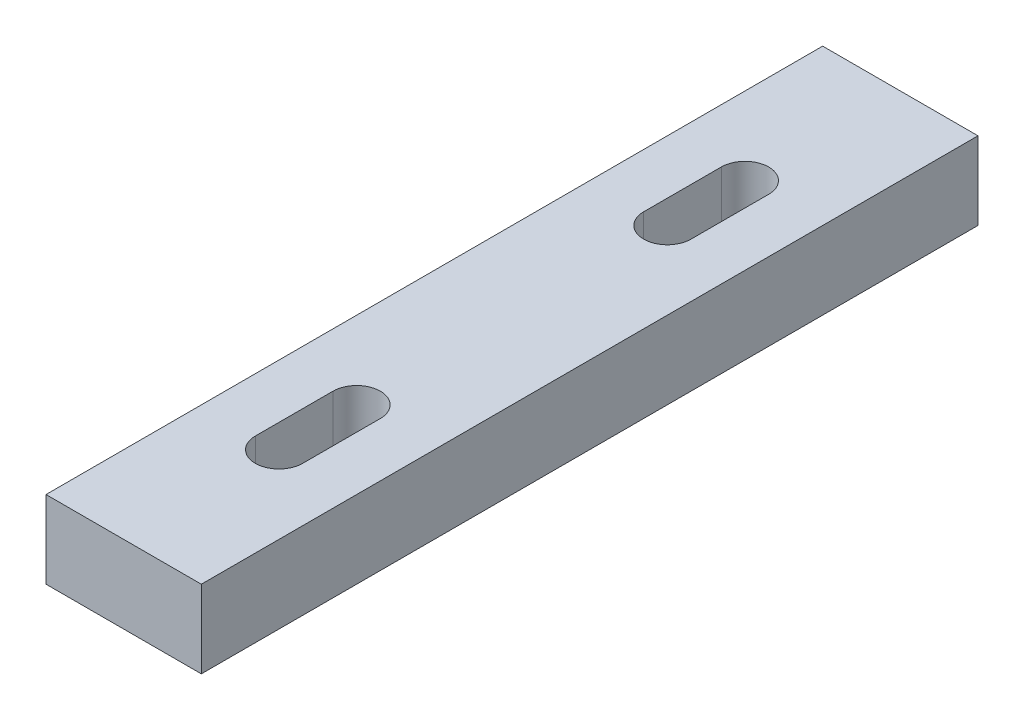
ISO-10303-21;
HEADER;
FILE_DESCRIPTION(('STEP AP214'),'2;1');
FILE_NAME('part.step','',(''),(''),'','','');
FILE_SCHEMA(('AUTOMOTIVE_DESIGN { 1 0 10303 214 1 1 1 1 }'));
ENDSEC;
DATA;
#1=APPLICATION_CONTEXT('core data for automotive mechanical design processes');
#2=APPLICATION_PROTOCOL_DEFINITION('international standard','automotive_design',2000,#1);
#3=PRODUCT_CONTEXT('',#1,'mechanical');
#4=PRODUCT('Part','Part','',(#3));
#5=PRODUCT_RELATED_PRODUCT_CATEGORY('part','',(#4));
#6=PRODUCT_DEFINITION_FORMATION('','',#4);
#7=PRODUCT_DEFINITION_CONTEXT('part definition',#1,'design');
#8=PRODUCT_DEFINITION('design','',#6,#7);
#9=PRODUCT_DEFINITION_SHAPE('','',#8);
#10=(LENGTH_UNIT() NAMED_UNIT(*) SI_UNIT(.MILLI.,.METRE.));
#11=(NAMED_UNIT(*) PLANE_ANGLE_UNIT() SI_UNIT($,.RADIAN.));
#12=(NAMED_UNIT(*) SI_UNIT($,.STERADIAN.) SOLID_ANGLE_UNIT());
#13=UNCERTAINTY_MEASURE_WITH_UNIT(LENGTH_MEASURE(1.E-05),#10,'distance_accuracy_value','');
#14=(GEOMETRIC_REPRESENTATION_CONTEXT(3) GLOBAL_UNCERTAINTY_ASSIGNED_CONTEXT((#13)) GLOBAL_UNIT_ASSIGNED_CONTEXT((#10,
#11,#12)) REPRESENTATION_CONTEXT('',''));
#15=CARTESIAN_POINT('',(0.,0.,0.));
#16=DIRECTION('',(0.,0.,1.));
#17=DIRECTION('',(1.,0.,0.));
#18=AXIS2_PLACEMENT_3D('',#15,#16,#17);
#19=CARTESIAN_POINT('',(9.99999999999999,10.,-50.));
#20=DIRECTION('',(-1.,0.,0.));
#21=DIRECTION('',(0.,0.,1.));
#22=AXIS2_PLACEMENT_3D('',#19,#20,#21);
#23=PLANE('',#22);
#24=DIRECTION('',(0.,0.,-1.));
#25=VECTOR('',#24,1.);
#26=CARTESIAN_POINT('',(9.99999999999999,0.,-50.));
#27=LINE('',#26,#25);
#28=CARTESIAN_POINT('',(10.,0.,50.));
#29=VERTEX_POINT('',#28);
#30=CARTESIAN_POINT('',(9.99999999999999,0.,-50.));
#31=VERTEX_POINT('',#30);
#32=EDGE_CURVE('E186',#29,#31,#27,.T.);
#33=ORIENTED_EDGE('',*,*,#32,.T.);
#34=DIRECTION('',(0.,-1.,0.));
#35=VECTOR('',#34,1.);
#36=CARTESIAN_POINT('',(9.99999999999999,10.,-50.));
#37=LINE('',#36,#35);
#38=CARTESIAN_POINT('',(9.99999999999999,10.,-50.));
#39=VERTEX_POINT('',#38);
#40=EDGE_CURVE('E11',#39,#31,#37,.T.);
#41=ORIENTED_EDGE('',*,*,#40,.F.);
#42=DIRECTION('',(0.,0.,-1.));
#43=VECTOR('',#42,1.);
#44=CARTESIAN_POINT('',(9.99999999999999,10.,-50.));
#45=LINE('',#44,#43);
#46=CARTESIAN_POINT('',(10.,10.,50.));
#47=VERTEX_POINT('',#46);
#48=EDGE_CURVE('E187',#47,#39,#45,.T.);
#49=ORIENTED_EDGE('',*,*,#48,.F.);
#50=DIRECTION('',(0.,-1.,0.));
#51=VECTOR('',#50,1.);
#52=CARTESIAN_POINT('',(10.,10.,50.));
#53=LINE('',#52,#51);
#54=EDGE_CURVE('E197',#47,#29,#53,.T.);
#55=ORIENTED_EDGE('',*,*,#54,.T.);
#56=EDGE_LOOP('',(#33,#41,#49,#55));
#57=FACE_BOUND('',#56,.T.);
#58=ADVANCED_FACE('F37',(#57),#23,.F.);
#59=CARTESIAN_POINT('',(-10.,10.,-50.));
#60=DIRECTION('',(0.,0.,1.));
#61=DIRECTION('',(1.,0.,0.));
#62=AXIS2_PLACEMENT_3D('',#59,#60,#61);
#63=PLANE('',#62);
#64=DIRECTION('',(-1.,0.,0.));
#65=VECTOR('',#64,1.);
#66=CARTESIAN_POINT('',(-10.,0.,-50.));
#67=LINE('',#66,#65);
#68=CARTESIAN_POINT('',(-10.,0.,-50.));
#69=VERTEX_POINT('',#68);
#70=EDGE_CURVE('E200',#31,#69,#67,.T.);
#71=ORIENTED_EDGE('',*,*,#70,.T.);
#72=DIRECTION('',(0.,-1.,0.));
#73=VECTOR('',#72,1.);
#74=CARTESIAN_POINT('',(-10.,10.,-50.));
#75=LINE('',#74,#73);
#76=CARTESIAN_POINT('',(-10.,10.,-50.));
#77=VERTEX_POINT('',#76);
#78=EDGE_CURVE('E44',#77,#69,#75,.T.);
#79=ORIENTED_EDGE('',*,*,#78,.F.);
#80=DIRECTION('',(-1.,0.,0.));
#81=VECTOR('',#80,1.);
#82=CARTESIAN_POINT('',(-10.,10.,-50.));
#83=LINE('',#82,#81);
#84=EDGE_CURVE('E190',#39,#77,#83,.T.);
#85=ORIENTED_EDGE('',*,*,#84,.F.);
#86=ORIENTED_EDGE('',*,*,#40,.T.);
#87=EDGE_LOOP('',(#71,#79,#85,#86));
#88=FACE_BOUND('',#87,.T.);
#89=ADVANCED_FACE('F229',(#88),#63,.F.);
#90=CARTESIAN_POINT('',(-10.,10.,-50.));
#91=DIRECTION('',(1.,0.,0.));
#92=DIRECTION('',(0.,0.,-1.));
#93=AXIS2_PLACEMENT_3D('',#90,#91,#92);
#94=PLANE('',#93);
#95=DIRECTION('',(0.,0.,1.));
#96=VECTOR('',#95,1.);
#97=CARTESIAN_POINT('',(-10.,0.,-50.));
#98=LINE('',#97,#96);
#99=CARTESIAN_POINT('',(-9.99999999999999,0.,50.));
#100=VERTEX_POINT('',#99);
#101=EDGE_CURVE('E202',#69,#100,#98,.T.);
#102=ORIENTED_EDGE('',*,*,#101,.T.);
#103=DIRECTION('',(0.,-1.,0.));
#104=VECTOR('',#103,1.);
#105=CARTESIAN_POINT('',(-9.99999999999999,10.,50.));
#106=LINE('',#105,#104);
#107=CARTESIAN_POINT('',(-9.99999999999999,10.,50.));
#108=VERTEX_POINT('',#107);
#109=EDGE_CURVE('E207',#108,#100,#106,.T.);
#110=ORIENTED_EDGE('',*,*,#109,.F.);
#111=DIRECTION('',(0.,0.,1.));
#112=VECTOR('',#111,1.);
#113=CARTESIAN_POINT('',(-10.,10.,-50.));
#114=LINE('',#113,#112);
#115=EDGE_CURVE('E193',#77,#108,#114,.T.);
#116=ORIENTED_EDGE('',*,*,#115,.F.);
#117=ORIENTED_EDGE('',*,*,#78,.T.);
#118=EDGE_LOOP('',(#102,#110,#116,#117));
#119=FACE_BOUND('',#118,.T.);
#120=ADVANCED_FACE('F214',(#119),#94,.F.);
#121=CARTESIAN_POINT('',(-9.99999999999999,10.,50.));
#122=DIRECTION('',(0.,0.,-1.));
#123=DIRECTION('',(-1.,0.,0.));
#124=AXIS2_PLACEMENT_3D('',#121,#122,#123);
#125=PLANE('',#124);
#126=DIRECTION('',(1.,0.,0.));
#127=VECTOR('',#126,1.);
#128=CARTESIAN_POINT('',(-9.99999999999999,0.,50.));
#129=LINE('',#128,#127);
#130=EDGE_CURVE('E191',#100,#29,#129,.T.);
#131=ORIENTED_EDGE('',*,*,#130,.T.);
#132=ORIENTED_EDGE('',*,*,#54,.F.);
#133=DIRECTION('',(1.,0.,0.));
#134=VECTOR('',#133,1.);
#135=CARTESIAN_POINT('',(-9.99999999999999,10.,50.));
#136=LINE('',#135,#134);
#137=EDGE_CURVE('E195',#108,#47,#136,.T.);
#138=ORIENTED_EDGE('',*,*,#137,.F.);
#139=ORIENTED_EDGE('',*,*,#109,.T.);
#140=EDGE_LOOP('',(#131,#132,#138,#139));
#141=FACE_BOUND('',#140,.T.);
#142=ADVANCED_FACE('F223',(#141),#125,.F.);
#143=CARTESIAN_POINT('',(0.,10.,0.));
#144=DIRECTION('',(0.,1.,0.));
#145=DIRECTION('',(0.,0.,1.));
#146=AXIS2_PLACEMENT_3D('',#143,#144,#145);
#147=PLANE('',#146);
#148=CARTESIAN_POINT('',(0.,10.,20.));
#149=DIRECTION('',(0.,-1.,0.));
#150=DIRECTION('',(0.,0.,-1.));
#151=AXIS2_PLACEMENT_3D('',#148,#149,#150);
#152=CIRCLE('',#151,3.05);
#153=CARTESIAN_POINT('',(-3.05,10.,20.));
#154=VERTEX_POINT('',#153);
#155=CARTESIAN_POINT('',(3.05,10.,20.));
#156=VERTEX_POINT('',#155);
#157=EDGE_CURVE('E144',#154,#156,#152,.T.);
#158=ORIENTED_EDGE('',*,*,#157,.T.);
#159=DIRECTION('',(0.,0.,1.));
#160=VECTOR('',#159,1.);
#161=CARTESIAN_POINT('',(3.05,10.,30.));
#162=LINE('',#161,#160);
#163=CARTESIAN_POINT('',(3.05,10.,30.));
#164=VERTEX_POINT('',#163);
#165=EDGE_CURVE('E128',#156,#164,#162,.T.);
#166=ORIENTED_EDGE('',*,*,#165,.T.);
#167=CARTESIAN_POINT('',(0.,10.,30.));
#168=DIRECTION('',(0.,-1.,0.));
#169=DIRECTION('',(0.,0.,-1.));
#170=AXIS2_PLACEMENT_3D('',#167,#168,#169);
#171=CIRCLE('',#170,3.05);
#172=CARTESIAN_POINT('',(-3.05,10.,30.));
#173=VERTEX_POINT('',#172);
#174=EDGE_CURVE('E136',#164,#173,#171,.T.);
#175=ORIENTED_EDGE('',*,*,#174,.T.);
#176=DIRECTION('',(0.,0.,-1.));
#177=VECTOR('',#176,1.);
#178=CARTESIAN_POINT('',(-3.05,10.,30.));
#179=LINE('',#178,#177);
#180=EDGE_CURVE('E51',#173,#154,#179,.T.);
#181=ORIENTED_EDGE('',*,*,#180,.T.);
#182=EDGE_LOOP('',(#158,#166,#175,#181));
#183=FACE_BOUND('',#182,.T.);
#184=CARTESIAN_POINT('',(0.,10.,-30.));
#185=DIRECTION('',(0.,1.,0.));
#186=DIRECTION('',(0.,0.,1.));
#187=AXIS2_PLACEMENT_3D('',#184,#185,#186);
#188=CIRCLE('',#187,3.05);
#189=CARTESIAN_POINT('',(3.05,10.,-30.));
#190=VERTEX_POINT('',#189);
#191=CARTESIAN_POINT('',(-3.05,10.,-30.));
#192=VERTEX_POINT('',#191);
#193=EDGE_CURVE('E165',#190,#192,#188,.T.);
#194=ORIENTED_EDGE('',*,*,#193,.F.);
#195=DIRECTION('',(0.,0.,-1.));
#196=VECTOR('',#195,1.);
#197=CARTESIAN_POINT('',(3.05,10.,-30.));
#198=LINE('',#197,#196);
#199=CARTESIAN_POINT('',(3.05,10.,-20.));
#200=VERTEX_POINT('',#199);
#201=EDGE_CURVE('E174',#200,#190,#198,.T.);
#202=ORIENTED_EDGE('',*,*,#201,.F.);
#203=CARTESIAN_POINT('',(0.,10.,-20.));
#204=DIRECTION('',(0.,1.,0.));
#205=DIRECTION('',(0.,0.,1.));
#206=AXIS2_PLACEMENT_3D('',#203,#204,#205);
#207=CIRCLE('',#206,3.05);
#208=CARTESIAN_POINT('',(-3.05,10.,-20.));
#209=VERTEX_POINT('',#208);
#210=EDGE_CURVE('E171',#209,#200,#207,.T.);
#211=ORIENTED_EDGE('',*,*,#210,.F.);
#212=DIRECTION('',(0.,0.,1.));
#213=VECTOR('',#212,1.);
#214=CARTESIAN_POINT('',(-3.05,10.,-30.));
#215=LINE('',#214,#213);
#216=EDGE_CURVE('E167',#192,#209,#215,.T.);
#217=ORIENTED_EDGE('',*,*,#216,.F.);
#218=EDGE_LOOP('',(#194,#202,#211,#217));
#219=FACE_BOUND('',#218,.T.);
#220=ORIENTED_EDGE('',*,*,#48,.T.);
#221=ORIENTED_EDGE('',*,*,#84,.T.);
#222=ORIENTED_EDGE('',*,*,#115,.T.);
#223=ORIENTED_EDGE('',*,*,#137,.T.);
#224=EDGE_LOOP('',(#220,#221,#222,#223));
#225=FACE_BOUND('',#224,.T.);
#226=ADVANCED_FACE('F141',(#183,#219,#225),#147,.T.);
#227=CARTESIAN_POINT('',(0.,0.,0.));
#228=DIRECTION('',(0.,1.,0.));
#229=DIRECTION('',(0.,0.,1.));
#230=AXIS2_PLACEMENT_3D('',#227,#228,#229);
#231=PLANE('',#230);
#232=DIRECTION('',(0.,0.,-1.));
#233=VECTOR('',#232,1.);
#234=CARTESIAN_POINT('',(3.05,0.,30.));
#235=LINE('',#234,#233);
#236=CARTESIAN_POINT('',(3.05,0.,30.));
#237=VERTEX_POINT('',#236);
#238=CARTESIAN_POINT('',(3.05,0.,20.));
#239=VERTEX_POINT('',#238);
#240=EDGE_CURVE('E131',#237,#239,#235,.T.);
#241=ORIENTED_EDGE('',*,*,#240,.T.);
#242=CARTESIAN_POINT('',(0.,0.,20.));
#243=DIRECTION('',(0.,1.,0.));
#244=DIRECTION('',(0.,0.,1.));
#245=AXIS2_PLACEMENT_3D('',#242,#243,#244);
#246=CIRCLE('',#245,3.05);
#247=CARTESIAN_POINT('',(-3.05,0.,20.));
#248=VERTEX_POINT('',#247);
#249=EDGE_CURVE('E155',#239,#248,#246,.T.);
#250=ORIENTED_EDGE('',*,*,#249,.T.);
#251=DIRECTION('',(0.,0.,1.));
#252=VECTOR('',#251,1.);
#253=CARTESIAN_POINT('',(-3.05,0.,30.));
#254=LINE('',#253,#252);
#255=CARTESIAN_POINT('',(-3.05,0.,30.));
#256=VERTEX_POINT('',#255);
#257=EDGE_CURVE('E274',#248,#256,#254,.T.);
#258=ORIENTED_EDGE('',*,*,#257,.T.);
#259=CARTESIAN_POINT('',(0.,0.,30.));
#260=DIRECTION('',(0.,1.,0.));
#261=DIRECTION('',(0.,0.,1.));
#262=AXIS2_PLACEMENT_3D('',#259,#260,#261);
#263=CIRCLE('',#262,3.05);
#264=EDGE_CURVE('E168',#256,#237,#263,.T.);
#265=ORIENTED_EDGE('',*,*,#264,.T.);
#266=EDGE_LOOP('',(#241,#250,#258,#265));
#267=FACE_BOUND('',#266,.T.);
#268=DIRECTION('',(0.,0.,1.));
#269=VECTOR('',#268,1.);
#270=CARTESIAN_POINT('',(3.05,0.,-30.));
#271=LINE('',#270,#269);
#272=CARTESIAN_POINT('',(3.05,0.,-30.));
#273=VERTEX_POINT('',#272);
#274=CARTESIAN_POINT('',(3.05,0.,-20.));
#275=VERTEX_POINT('',#274);
#276=EDGE_CURVE('E159',#273,#275,#271,.T.);
#277=ORIENTED_EDGE('',*,*,#276,.F.);
#278=CARTESIAN_POINT('',(0.,0.,-30.));
#279=DIRECTION('',(0.,1.,0.));
#280=DIRECTION('',(0.,0.,1.));
#281=AXIS2_PLACEMENT_3D('',#278,#279,#280);
#282=CIRCLE('',#281,3.05);
#283=CARTESIAN_POINT('',(-3.05,0.,-30.));
#284=VERTEX_POINT('',#283);
#285=EDGE_CURVE('E162',#284,#273,#282,.F.);
#286=ORIENTED_EDGE('',*,*,#285,.F.);
#287=DIRECTION('',(0.,0.,-1.));
#288=VECTOR('',#287,1.);
#289=CARTESIAN_POINT('',(-3.05,0.,-30.));
#290=LINE('',#289,#288);
#291=CARTESIAN_POINT('',(-3.05,0.,-20.));
#292=VERTEX_POINT('',#291);
#293=EDGE_CURVE('E164',#292,#284,#290,.T.);
#294=ORIENTED_EDGE('',*,*,#293,.F.);
#295=CARTESIAN_POINT('',(0.,0.,-20.));
#296=DIRECTION('',(0.,1.,0.));
#297=DIRECTION('',(0.,0.,1.));
#298=AXIS2_PLACEMENT_3D('',#295,#296,#297);
#299=CIRCLE('',#298,3.05);
#300=EDGE_CURVE('E156',#275,#292,#299,.F.);
#301=ORIENTED_EDGE('',*,*,#300,.F.);
#302=EDGE_LOOP('',(#277,#286,#294,#301));
#303=FACE_BOUND('',#302,.T.);
#304=ORIENTED_EDGE('',*,*,#32,.F.);
#305=ORIENTED_EDGE('',*,*,#130,.F.);
#306=ORIENTED_EDGE('',*,*,#101,.F.);
#307=ORIENTED_EDGE('',*,*,#70,.F.);
#308=EDGE_LOOP('',(#304,#305,#306,#307));
#309=FACE_BOUND('',#308,.T.);
#310=ADVANCED_FACE('F220',(#267,#303,#309),#231,.F.);
#311=CARTESIAN_POINT('',(0.,-17.2168522093907,-30.));
#312=DIRECTION('',(0.,1.,0.));
#313=DIRECTION('',(0.,0.,1.));
#314=AXIS2_PLACEMENT_3D('',#311,#312,#313);
#315=CYLINDRICAL_SURFACE('',#314,3.05);
#316=ORIENTED_EDGE('',*,*,#285,.T.);
#317=DIRECTION('',(0.,1.,0.));
#318=VECTOR('',#317,1.);
#319=CARTESIAN_POINT('',(3.05,-17.2168522093907,-30.));
#320=LINE('',#319,#318);
#321=EDGE_CURVE('E160',#273,#190,#320,.T.);
#322=ORIENTED_EDGE('',*,*,#321,.T.);
#323=ORIENTED_EDGE('',*,*,#193,.T.);
#324=DIRECTION('',(0.,1.,0.));
#325=VECTOR('',#324,1.);
#326=CARTESIAN_POINT('',(-3.05,-17.2168522093907,-30.));
#327=LINE('',#326,#325);
#328=EDGE_CURVE('E177',#284,#192,#327,.T.);
#329=ORIENTED_EDGE('',*,*,#328,.F.);
#330=EDGE_LOOP('',(#316,#322,#323,#329));
#331=FACE_BOUND('',#330,.T.);
#332=ADVANCED_FACE('F241',(#331),#315,.F.);
#333=CARTESIAN_POINT('',(3.05,-17.2168522093907,-30.));
#334=DIRECTION('',(1.,0.,0.));
#335=DIRECTION('',(0.,0.,-1.));
#336=AXIS2_PLACEMENT_3D('',#333,#334,#335);
#337=PLANE('',#336);
#338=ORIENTED_EDGE('',*,*,#276,.T.);
#339=DIRECTION('',(0.,1.,0.));
#340=VECTOR('',#339,1.);
#341=CARTESIAN_POINT('',(3.05,-17.2168522093907,-20.));
#342=LINE('',#341,#340);
#343=EDGE_CURVE('E179',#275,#200,#342,.T.);
#344=ORIENTED_EDGE('',*,*,#343,.T.);
#345=ORIENTED_EDGE('',*,*,#201,.T.);
#346=ORIENTED_EDGE('',*,*,#321,.F.);
#347=EDGE_LOOP('',(#338,#344,#345,#346));
#348=FACE_BOUND('',#347,.T.);
#349=ADVANCED_FACE('F247',(#348),#337,.F.);
#350=CARTESIAN_POINT('',(0.,-17.2168522093907,-20.));
#351=DIRECTION('',(0.,1.,0.));
#352=DIRECTION('',(0.,0.,1.));
#353=AXIS2_PLACEMENT_3D('',#350,#351,#352);
#354=CYLINDRICAL_SURFACE('',#353,3.05);
#355=ORIENTED_EDGE('',*,*,#300,.T.);
#356=DIRECTION('',(0.,1.,0.));
#357=VECTOR('',#356,1.);
#358=CARTESIAN_POINT('',(-3.05,-17.2168522093907,-20.));
#359=LINE('',#358,#357);
#360=EDGE_CURVE('E181',#292,#209,#359,.T.);
#361=ORIENTED_EDGE('',*,*,#360,.T.);
#362=ORIENTED_EDGE('',*,*,#210,.T.);
#363=ORIENTED_EDGE('',*,*,#343,.F.);
#364=EDGE_LOOP('',(#355,#361,#362,#363));
#365=FACE_BOUND('',#364,.T.);
#366=ADVANCED_FACE('F252',(#365),#354,.F.);
#367=CARTESIAN_POINT('',(-3.05,-17.2168522093907,-30.));
#368=DIRECTION('',(-1.,0.,0.));
#369=DIRECTION('',(0.,0.,1.));
#370=AXIS2_PLACEMENT_3D('',#367,#368,#369);
#371=PLANE('',#370);
#372=ORIENTED_EDGE('',*,*,#293,.T.);
#373=ORIENTED_EDGE('',*,*,#328,.T.);
#374=ORIENTED_EDGE('',*,*,#216,.T.);
#375=ORIENTED_EDGE('',*,*,#360,.F.);
#376=EDGE_LOOP('',(#372,#373,#374,#375));
#377=FACE_BOUND('',#376,.T.);
#378=ADVANCED_FACE('F249',(#377),#371,.F.);
#379=CARTESIAN_POINT('',(3.05,-17.2168522093907,30.));
#380=DIRECTION('',(-1.,0.,0.));
#381=DIRECTION('',(0.,0.,1.));
#382=AXIS2_PLACEMENT_3D('',#379,#380,#381);
#383=PLANE('',#382);
#384=DIRECTION('',(0.,1.,0.));
#385=VECTOR('',#384,1.);
#386=CARTESIAN_POINT('',(3.05,-17.2168522093907,30.));
#387=LINE('',#386,#385);
#388=EDGE_CURVE('E59',#237,#164,#387,.T.);
#389=ORIENTED_EDGE('',*,*,#388,.T.);
#390=ORIENTED_EDGE('',*,*,#165,.F.);
#391=DIRECTION('',(0.,1.,0.));
#392=VECTOR('',#391,1.);
#393=CARTESIAN_POINT('',(3.05,-17.2168522093907,20.));
#394=LINE('',#393,#392);
#395=EDGE_CURVE('E133',#239,#156,#394,.T.);
#396=ORIENTED_EDGE('',*,*,#395,.F.);
#397=ORIENTED_EDGE('',*,*,#240,.F.);
#398=EDGE_LOOP('',(#389,#390,#396,#397));
#399=FACE_BOUND('',#398,.T.);
#400=ADVANCED_FACE('F125',(#399),#383,.T.);
#401=CARTESIAN_POINT('',(0.,-17.2168522093907,20.));
#402=DIRECTION('',(0.,1.,0.));
#403=DIRECTION('',(0.,0.,1.));
#404=AXIS2_PLACEMENT_3D('',#401,#402,#403);
#405=CYLINDRICAL_SURFACE('',#404,3.05);
#406=ORIENTED_EDGE('',*,*,#395,.T.);
#407=ORIENTED_EDGE('',*,*,#157,.F.);
#408=DIRECTION('',(0.,1.,0.));
#409=VECTOR('',#408,1.);
#410=CARTESIAN_POINT('',(-3.05,-17.2168522093907,20.));
#411=LINE('',#410,#409);
#412=EDGE_CURVE('E151',#248,#154,#411,.T.);
#413=ORIENTED_EDGE('',*,*,#412,.F.);
#414=ORIENTED_EDGE('',*,*,#249,.F.);
#415=EDGE_LOOP('',(#406,#407,#413,#414));
#416=FACE_BOUND('',#415,.T.);
#417=ADVANCED_FACE('F265',(#416),#405,.F.);
#418=CARTESIAN_POINT('',(-3.05,-17.2168522093907,30.));
#419=DIRECTION('',(1.,0.,0.));
#420=DIRECTION('',(0.,0.,-1.));
#421=AXIS2_PLACEMENT_3D('',#418,#419,#420);
#422=PLANE('',#421);
#423=ORIENTED_EDGE('',*,*,#412,.T.);
#424=ORIENTED_EDGE('',*,*,#180,.F.);
#425=DIRECTION('',(0.,1.,0.));
#426=VECTOR('',#425,1.);
#427=CARTESIAN_POINT('',(-3.05,-17.2168522093907,30.));
#428=LINE('',#427,#426);
#429=EDGE_CURVE('E138',#256,#173,#428,.T.);
#430=ORIENTED_EDGE('',*,*,#429,.F.);
#431=ORIENTED_EDGE('',*,*,#257,.F.);
#432=EDGE_LOOP('',(#423,#424,#430,#431));
#433=FACE_BOUND('',#432,.T.);
#434=ADVANCED_FACE('F262',(#433),#422,.T.);
#435=CARTESIAN_POINT('',(0.,-17.2168522093907,30.));
#436=DIRECTION('',(0.,1.,0.));
#437=DIRECTION('',(0.,0.,1.));
#438=AXIS2_PLACEMENT_3D('',#435,#436,#437);
#439=CYLINDRICAL_SURFACE('',#438,3.05);
#440=ORIENTED_EDGE('',*,*,#429,.T.);
#441=ORIENTED_EDGE('',*,*,#174,.F.);
#442=ORIENTED_EDGE('',*,*,#388,.F.);
#443=ORIENTED_EDGE('',*,*,#264,.F.);
#444=EDGE_LOOP('',(#440,#441,#442,#443));
#445=FACE_BOUND('',#444,.T.);
#446=ADVANCED_FACE('F137',(#445),#439,.F.);
#447=CLOSED_SHELL('',(#58,#89,#120,#142,#226,#310,#332,#349,#366,#378,#400,#417,#434,#446));
#448=MANIFOLD_SOLID_BREP('B2',#447);
#449=ADVANCED_BREP_SHAPE_REPRESENTATION('',(#18,#448),#14);
#450=SHAPE_DEFINITION_REPRESENTATION(#9,#449);
ENDSEC;
END-ISO-10303-21;
